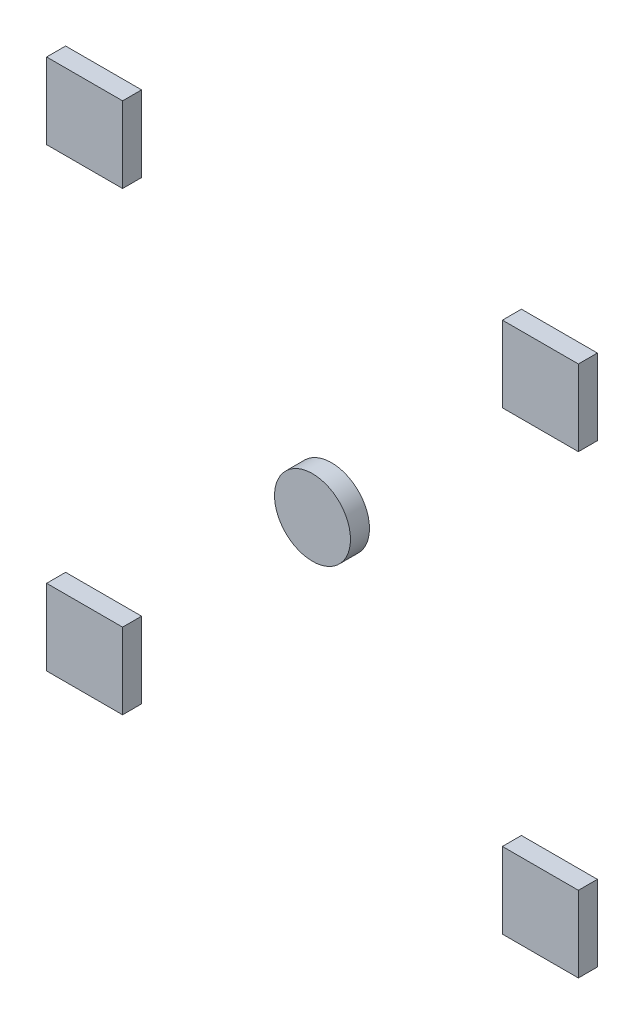
ISO-10303-21;
HEADER;
FILE_DESCRIPTION(('STEP AP214'),'2;1');
FILE_NAME('part.step','',(''),(''),'','','');
FILE_SCHEMA(('AUTOMOTIVE_DESIGN { 1 0 10303 214 1 1 1 1 }'));
ENDSEC;
DATA;
#1=APPLICATION_CONTEXT('core data for automotive mechanical design processes');
#2=APPLICATION_PROTOCOL_DEFINITION('international standard','automotive_design',2000,#1);
#3=PRODUCT_CONTEXT('',#1,'mechanical');
#4=PRODUCT('Part','Part','',(#3));
#5=PRODUCT_RELATED_PRODUCT_CATEGORY('part','',(#4));
#6=PRODUCT_DEFINITION_FORMATION('','',#4);
#7=PRODUCT_DEFINITION_CONTEXT('part definition',#1,'design');
#8=PRODUCT_DEFINITION('design','',#6,#7);
#9=PRODUCT_DEFINITION_SHAPE('','',#8);
#10=(LENGTH_UNIT() NAMED_UNIT(*) SI_UNIT(.MILLI.,.METRE.));
#11=(NAMED_UNIT(*) PLANE_ANGLE_UNIT() SI_UNIT($,.RADIAN.));
#12=(NAMED_UNIT(*) SI_UNIT($,.STERADIAN.) SOLID_ANGLE_UNIT());
#13=UNCERTAINTY_MEASURE_WITH_UNIT(LENGTH_MEASURE(1.E-05),#10,'distance_accuracy_value','');
#14=(GEOMETRIC_REPRESENTATION_CONTEXT(3) GLOBAL_UNCERTAINTY_ASSIGNED_CONTEXT((#13)) GLOBAL_UNIT_ASSIGNED_CONTEXT((#10,
#11,#12)) REPRESENTATION_CONTEXT('',''));
#15=CARTESIAN_POINT('',(0.,0.,0.));
#16=DIRECTION('',(0.,0.,1.));
#17=DIRECTION('',(1.,0.,0.));
#18=AXIS2_PLACEMENT_3D('',#15,#16,#17);
#19=CARTESIAN_POINT('',(120.,120.,5.));
#20=DIRECTION('',(0.,1.,0.));
#21=DIRECTION('',(0.,0.,1.));
#22=AXIS2_PLACEMENT_3D('',#19,#20,#21);
#23=PLANE('',#22);
#24=DIRECTION('',(1.,0.,0.));
#25=VECTOR('',#24,1.);
#26=CARTESIAN_POINT('',(120.,120.,0.));
#27=LINE('',#26,#25);
#28=CARTESIAN_POINT('',(120.,120.,0.));
#29=VERTEX_POINT('',#28);
#30=CARTESIAN_POINT('',(140.,120.,0.));
#31=VERTEX_POINT('',#30);
#32=EDGE_CURVE('E105',#29,#31,#27,.T.);
#33=ORIENTED_EDGE('',*,*,#32,.T.);
#34=DIRECTION('',(0.,0.,-1.));
#35=VECTOR('',#34,1.);
#36=CARTESIAN_POINT('',(140.,120.,5.));
#37=LINE('',#36,#35);
#38=CARTESIAN_POINT('',(140.,120.,5.));
#39=VERTEX_POINT('',#38);
#40=EDGE_CURVE('E12',#39,#31,#37,.T.);
#41=ORIENTED_EDGE('',*,*,#40,.F.);
#42=DIRECTION('',(1.,0.,0.));
#43=VECTOR('',#42,1.);
#44=CARTESIAN_POINT('',(120.,120.,5.));
#45=LINE('',#44,#43);
#46=CARTESIAN_POINT('',(120.,120.,5.));
#47=VERTEX_POINT('',#46);
#48=EDGE_CURVE('E93',#47,#39,#45,.T.);
#49=ORIENTED_EDGE('',*,*,#48,.F.);
#50=DIRECTION('',(0.,0.,-1.));
#51=VECTOR('',#50,1.);
#52=CARTESIAN_POINT('',(120.,120.,5.));
#53=LINE('',#52,#51);
#54=EDGE_CURVE('E101',#47,#29,#53,.T.);
#55=ORIENTED_EDGE('',*,*,#54,.T.);
#56=EDGE_LOOP('',(#33,#41,#49,#55));
#57=FACE_BOUND('',#56,.T.);
#58=ADVANCED_FACE('F42',(#57),#23,.F.);
#59=CARTESIAN_POINT('',(140.,120.,5.));
#60=DIRECTION('',(-1.,0.,0.));
#61=DIRECTION('',(0.,0.,1.));
#62=AXIS2_PLACEMENT_3D('',#59,#60,#61);
#63=PLANE('',#62);
#64=DIRECTION('',(0.,1.,0.));
#65=VECTOR('',#64,1.);
#66=CARTESIAN_POINT('',(140.,120.,0.));
#67=LINE('',#66,#65);
#68=CARTESIAN_POINT('',(140.,140.,0.));
#69=VERTEX_POINT('',#68);
#70=EDGE_CURVE('E97',#31,#69,#67,.T.);
#71=ORIENTED_EDGE('',*,*,#70,.T.);
#72=DIRECTION('',(0.,0.,-1.));
#73=VECTOR('',#72,1.);
#74=CARTESIAN_POINT('',(140.,140.,5.));
#75=LINE('',#74,#73);
#76=CARTESIAN_POINT('',(140.,140.,5.));
#77=VERTEX_POINT('',#76);
#78=EDGE_CURVE('E50',#77,#69,#75,.T.);
#79=ORIENTED_EDGE('',*,*,#78,.F.);
#80=DIRECTION('',(0.,1.,0.));
#81=VECTOR('',#80,1.);
#82=CARTESIAN_POINT('',(140.,120.,5.));
#83=LINE('',#82,#81);
#84=EDGE_CURVE('E88',#39,#77,#83,.T.);
#85=ORIENTED_EDGE('',*,*,#84,.F.);
#86=ORIENTED_EDGE('',*,*,#40,.T.);
#87=EDGE_LOOP('',(#71,#79,#85,#86));
#88=FACE_BOUND('',#87,.T.);
#89=ADVANCED_FACE('F96',(#88),#63,.F.);
#90=CARTESIAN_POINT('',(120.,140.,5.));
#91=DIRECTION('',(0.,-1.,0.));
#92=DIRECTION('',(0.,0.,-1.));
#93=AXIS2_PLACEMENT_3D('',#90,#91,#92);
#94=PLANE('',#93);
#95=DIRECTION('',(-1.,0.,0.));
#96=VECTOR('',#95,1.);
#97=CARTESIAN_POINT('',(120.,140.,0.));
#98=LINE('',#97,#96);
#99=CARTESIAN_POINT('',(120.,140.,0.));
#100=VERTEX_POINT('',#99);
#101=EDGE_CURVE('E75',#69,#100,#98,.T.);
#102=ORIENTED_EDGE('',*,*,#101,.T.);
#103=DIRECTION('',(0.,0.,-1.));
#104=VECTOR('',#103,1.);
#105=CARTESIAN_POINT('',(120.,140.,5.));
#106=LINE('',#105,#104);
#107=CARTESIAN_POINT('',(120.,140.,5.));
#108=VERTEX_POINT('',#107);
#109=EDGE_CURVE('E98',#108,#100,#106,.T.);
#110=ORIENTED_EDGE('',*,*,#109,.F.);
#111=DIRECTION('',(-1.,0.,0.));
#112=VECTOR('',#111,1.);
#113=CARTESIAN_POINT('',(120.,140.,5.));
#114=LINE('',#113,#112);
#115=EDGE_CURVE('E91',#77,#108,#114,.T.);
#116=ORIENTED_EDGE('',*,*,#115,.F.);
#117=ORIENTED_EDGE('',*,*,#78,.T.);
#118=EDGE_LOOP('',(#102,#110,#116,#117));
#119=FACE_BOUND('',#118,.T.);
#120=ADVANCED_FACE('F99',(#119),#94,.F.);
#121=CARTESIAN_POINT('',(120.,120.,5.));
#122=DIRECTION('',(1.,0.,0.));
#123=DIRECTION('',(0.,0.,-1.));
#124=AXIS2_PLACEMENT_3D('',#121,#122,#123);
#125=PLANE('',#124);
#126=DIRECTION('',(0.,-1.,0.));
#127=VECTOR('',#126,1.);
#128=CARTESIAN_POINT('',(120.,120.,0.));
#129=LINE('',#128,#127);
#130=EDGE_CURVE('E81',#100,#29,#129,.T.);
#131=ORIENTED_EDGE('',*,*,#130,.T.);
#132=ORIENTED_EDGE('',*,*,#54,.F.);
#133=DIRECTION('',(0.,-1.,0.));
#134=VECTOR('',#133,1.);
#135=CARTESIAN_POINT('',(120.,120.,5.));
#136=LINE('',#135,#134);
#137=EDGE_CURVE('E58',#108,#47,#136,.T.);
#138=ORIENTED_EDGE('',*,*,#137,.F.);
#139=ORIENTED_EDGE('',*,*,#109,.T.);
#140=EDGE_LOOP('',(#131,#132,#138,#139));
#141=FACE_BOUND('',#140,.T.);
#142=ADVANCED_FACE('F112',(#141),#125,.F.);
#143=CARTESIAN_POINT('',(140.,120.,5.));
#144=DIRECTION('',(0.,0.,1.));
#145=DIRECTION('',(1.,0.,0.));
#146=AXIS2_PLACEMENT_3D('',#143,#144,#145);
#147=PLANE('',#146);
#148=ORIENTED_EDGE('',*,*,#48,.T.);
#149=ORIENTED_EDGE('',*,*,#84,.T.);
#150=ORIENTED_EDGE('',*,*,#115,.T.);
#151=ORIENTED_EDGE('',*,*,#137,.T.);
#152=EDGE_LOOP('',(#148,#149,#150,#151));
#153=FACE_BOUND('',#152,.T.);
#154=ADVANCED_FACE('F89',(#153),#147,.T.);
#155=CARTESIAN_POINT('',(140.,120.,0.));
#156=DIRECTION('',(0.,0.,1.));
#157=DIRECTION('',(1.,0.,0.));
#158=AXIS2_PLACEMENT_3D('',#155,#156,#157);
#159=PLANE('',#158);
#160=ORIENTED_EDGE('',*,*,#32,.F.);
#161=ORIENTED_EDGE('',*,*,#130,.F.);
#162=ORIENTED_EDGE('',*,*,#101,.F.);
#163=ORIENTED_EDGE('',*,*,#70,.F.);
#164=EDGE_LOOP('',(#160,#161,#162,#163));
#165=FACE_BOUND('',#164,.T.);
#166=ADVANCED_FACE('F115',(#165),#159,.F.);
#167=CLOSED_SHELL('',(#58,#89,#120,#142,#154,#166));
#168=MANIFOLD_SOLID_BREP('B2',#167);
#169=CARTESIAN_POINT('',(-4.18978003333126E-13,120.,5.));
#170=DIRECTION('',(0.,1.,0.));
#171=DIRECTION('',(0.,0.,1.));
#172=AXIS2_PLACEMENT_3D('',#169,#170,#171);
#173=PLANE('',#172);
#174=DIRECTION('',(1.,0.,0.));
#175=VECTOR('',#174,1.);
#176=CARTESIAN_POINT('',(-4.18978003333126E-13,120.,0.));
#177=LINE('',#176,#175);
#178=CARTESIAN_POINT('',(-4.18978003333126E-13,120.,0.));
#179=VERTEX_POINT('',#178);
#180=CARTESIAN_POINT('',(19.9999999999996,120.,0.));
#181=VERTEX_POINT('',#180);
#182=EDGE_CURVE('E239',#179,#181,#177,.T.);
#183=ORIENTED_EDGE('',*,*,#182,.T.);
#184=DIRECTION('',(0.,0.,-1.));
#185=VECTOR('',#184,1.);
#186=CARTESIAN_POINT('',(19.9999999999996,120.,5.));
#187=LINE('',#186,#185);
#188=CARTESIAN_POINT('',(19.9999999999996,120.,5.));
#189=VERTEX_POINT('',#188);
#190=EDGE_CURVE('E40',#189,#181,#187,.T.);
#191=ORIENTED_EDGE('',*,*,#190,.F.);
#192=DIRECTION('',(1.,0.,0.));
#193=VECTOR('',#192,1.);
#194=CARTESIAN_POINT('',(-4.18978003333126E-13,120.,5.));
#195=LINE('',#194,#193);
#196=CARTESIAN_POINT('',(-4.18978003333126E-13,120.,5.));
#197=VERTEX_POINT('',#196);
#198=EDGE_CURVE('E227',#197,#189,#195,.T.);
#199=ORIENTED_EDGE('',*,*,#198,.F.);
#200=DIRECTION('',(0.,0.,-1.));
#201=VECTOR('',#200,1.);
#202=CARTESIAN_POINT('',(-4.18978003333126E-13,120.,5.));
#203=LINE('',#202,#201);
#204=EDGE_CURVE('E235',#197,#179,#203,.T.);
#205=ORIENTED_EDGE('',*,*,#204,.T.);
#206=EDGE_LOOP('',(#183,#191,#199,#205));
#207=FACE_BOUND('',#206,.T.);
#208=ADVANCED_FACE('F176',(#207),#173,.F.);
#209=CARTESIAN_POINT('',(19.9999999999996,120.,5.));
#210=DIRECTION('',(-1.,0.,0.));
#211=DIRECTION('',(0.,0.,1.));
#212=AXIS2_PLACEMENT_3D('',#209,#210,#211);
#213=PLANE('',#212);
#214=DIRECTION('',(0.,1.,0.));
#215=VECTOR('',#214,1.);
#216=CARTESIAN_POINT('',(19.9999999999996,120.,0.));
#217=LINE('',#216,#215);
#218=CARTESIAN_POINT('',(19.9999999999996,140.,0.));
#219=VERTEX_POINT('',#218);
#220=EDGE_CURVE('E231',#181,#219,#217,.T.);
#221=ORIENTED_EDGE('',*,*,#220,.T.);
#222=DIRECTION('',(0.,0.,-1.));
#223=VECTOR('',#222,1.);
#224=CARTESIAN_POINT('',(19.9999999999996,140.,5.));
#225=LINE('',#224,#223);
#226=CARTESIAN_POINT('',(19.9999999999996,140.,5.));
#227=VERTEX_POINT('',#226);
#228=EDGE_CURVE('E184',#227,#219,#225,.T.);
#229=ORIENTED_EDGE('',*,*,#228,.F.);
#230=DIRECTION('',(0.,1.,0.));
#231=VECTOR('',#230,1.);
#232=CARTESIAN_POINT('',(19.9999999999996,120.,5.));
#233=LINE('',#232,#231);
#234=EDGE_CURVE('E222',#189,#227,#233,.T.);
#235=ORIENTED_EDGE('',*,*,#234,.F.);
#236=ORIENTED_EDGE('',*,*,#190,.T.);
#237=EDGE_LOOP('',(#221,#229,#235,#236));
#238=FACE_BOUND('',#237,.T.);
#239=ADVANCED_FACE('F230',(#238),#213,.F.);
#240=CARTESIAN_POINT('',(-4.18978003333126E-13,140.,5.));
#241=DIRECTION('',(0.,-1.,0.));
#242=DIRECTION('',(0.,0.,-1.));
#243=AXIS2_PLACEMENT_3D('',#240,#241,#242);
#244=PLANE('',#243);
#245=DIRECTION('',(-1.,0.,0.));
#246=VECTOR('',#245,1.);
#247=CARTESIAN_POINT('',(-4.18978003333126E-13,140.,0.));
#248=LINE('',#247,#246);
#249=CARTESIAN_POINT('',(-4.18978003333126E-13,140.,0.));
#250=VERTEX_POINT('',#249);
#251=EDGE_CURVE('E209',#219,#250,#248,.T.);
#252=ORIENTED_EDGE('',*,*,#251,.T.);
#253=DIRECTION('',(0.,0.,-1.));
#254=VECTOR('',#253,1.);
#255=CARTESIAN_POINT('',(-4.18978003333126E-13,140.,5.));
#256=LINE('',#255,#254);
#257=CARTESIAN_POINT('',(-4.18978003333126E-13,140.,5.));
#258=VERTEX_POINT('',#257);
#259=EDGE_CURVE('E232',#258,#250,#256,.T.);
#260=ORIENTED_EDGE('',*,*,#259,.F.);
#261=DIRECTION('',(-1.,0.,0.));
#262=VECTOR('',#261,1.);
#263=CARTESIAN_POINT('',(-4.18978003333126E-13,140.,5.));
#264=LINE('',#263,#262);
#265=EDGE_CURVE('E225',#227,#258,#264,.T.);
#266=ORIENTED_EDGE('',*,*,#265,.F.);
#267=ORIENTED_EDGE('',*,*,#228,.T.);
#268=EDGE_LOOP('',(#252,#260,#266,#267));
#269=FACE_BOUND('',#268,.T.);
#270=ADVANCED_FACE('F233',(#269),#244,.F.);
#271=CARTESIAN_POINT('',(-4.18978003333126E-13,120.,5.));
#272=DIRECTION('',(1.,0.,0.));
#273=DIRECTION('',(0.,0.,-1.));
#274=AXIS2_PLACEMENT_3D('',#271,#272,#273);
#275=PLANE('',#274);
#276=DIRECTION('',(0.,-1.,0.));
#277=VECTOR('',#276,1.);
#278=CARTESIAN_POINT('',(-4.18978003333126E-13,120.,0.));
#279=LINE('',#278,#277);
#280=EDGE_CURVE('E215',#250,#179,#279,.T.);
#281=ORIENTED_EDGE('',*,*,#280,.T.);
#282=ORIENTED_EDGE('',*,*,#204,.F.);
#283=DIRECTION('',(0.,-1.,0.));
#284=VECTOR('',#283,1.);
#285=CARTESIAN_POINT('',(-4.18978003333126E-13,120.,5.));
#286=LINE('',#285,#284);
#287=EDGE_CURVE('E192',#258,#197,#286,.T.);
#288=ORIENTED_EDGE('',*,*,#287,.F.);
#289=ORIENTED_EDGE('',*,*,#259,.T.);
#290=EDGE_LOOP('',(#281,#282,#288,#289));
#291=FACE_BOUND('',#290,.T.);
#292=ADVANCED_FACE('F246',(#291),#275,.F.);
#293=CARTESIAN_POINT('',(19.9999999999996,120.,5.));
#294=DIRECTION('',(0.,0.,1.));
#295=DIRECTION('',(1.,0.,0.));
#296=AXIS2_PLACEMENT_3D('',#293,#294,#295);
#297=PLANE('',#296);
#298=ORIENTED_EDGE('',*,*,#198,.T.);
#299=ORIENTED_EDGE('',*,*,#234,.T.);
#300=ORIENTED_EDGE('',*,*,#265,.T.);
#301=ORIENTED_EDGE('',*,*,#287,.T.);
#302=EDGE_LOOP('',(#298,#299,#300,#301));
#303=FACE_BOUND('',#302,.T.);
#304=ADVANCED_FACE('F223',(#303),#297,.T.);
#305=CARTESIAN_POINT('',(19.9999999999996,120.,0.));
#306=DIRECTION('',(0.,0.,1.));
#307=DIRECTION('',(1.,0.,0.));
#308=AXIS2_PLACEMENT_3D('',#305,#306,#307);
#309=PLANE('',#308);
#310=ORIENTED_EDGE('',*,*,#182,.F.);
#311=ORIENTED_EDGE('',*,*,#280,.F.);
#312=ORIENTED_EDGE('',*,*,#251,.F.);
#313=ORIENTED_EDGE('',*,*,#220,.F.);
#314=EDGE_LOOP('',(#310,#311,#312,#313));
#315=FACE_BOUND('',#314,.T.);
#316=ADVANCED_FACE('F249',(#315),#309,.F.);
#317=CLOSED_SHELL('',(#208,#239,#270,#292,#304,#316));
#318=MANIFOLD_SOLID_BREP('B6',#317);
#319=CARTESIAN_POINT('',(120.,0.,5.));
#320=DIRECTION('',(0.,1.,0.));
#321=DIRECTION('',(0.,0.,1.));
#322=AXIS2_PLACEMENT_3D('',#319,#320,#321);
#323=PLANE('',#322);
#324=DIRECTION('',(1.,0.,0.));
#325=VECTOR('',#324,1.);
#326=CARTESIAN_POINT('',(120.,0.,0.));
#327=LINE('',#326,#325);
#328=CARTESIAN_POINT('',(120.,0.,0.));
#329=VERTEX_POINT('',#328);
#330=CARTESIAN_POINT('',(140.,0.,0.));
#331=VERTEX_POINT('',#330);
#332=EDGE_CURVE('E371',#329,#331,#327,.T.);
#333=ORIENTED_EDGE('',*,*,#332,.T.);
#334=DIRECTION('',(0.,0.,-1.));
#335=VECTOR('',#334,1.);
#336=CARTESIAN_POINT('',(140.,0.,5.));
#337=LINE('',#336,#335);
#338=CARTESIAN_POINT('',(140.,0.,5.));
#339=VERTEX_POINT('',#338);
#340=EDGE_CURVE('E174',#339,#331,#337,.T.);
#341=ORIENTED_EDGE('',*,*,#340,.F.);
#342=DIRECTION('',(1.,0.,0.));
#343=VECTOR('',#342,1.);
#344=CARTESIAN_POINT('',(120.,0.,5.));
#345=LINE('',#344,#343);
#346=CARTESIAN_POINT('',(120.,0.,5.));
#347=VERTEX_POINT('',#346);
#348=EDGE_CURVE('E359',#347,#339,#345,.T.);
#349=ORIENTED_EDGE('',*,*,#348,.F.);
#350=DIRECTION('',(0.,0.,-1.));
#351=VECTOR('',#350,1.);
#352=CARTESIAN_POINT('',(120.,0.,5.));
#353=LINE('',#352,#351);
#354=EDGE_CURVE('E367',#347,#329,#353,.T.);
#355=ORIENTED_EDGE('',*,*,#354,.T.);
#356=EDGE_LOOP('',(#333,#341,#349,#355));
#357=FACE_BOUND('',#356,.T.);
#358=ADVANCED_FACE('F308',(#357),#323,.F.);
#359=CARTESIAN_POINT('',(140.,0.,5.));
#360=DIRECTION('',(-1.,0.,0.));
#361=DIRECTION('',(0.,0.,1.));
#362=AXIS2_PLACEMENT_3D('',#359,#360,#361);
#363=PLANE('',#362);
#364=DIRECTION('',(0.,1.,0.));
#365=VECTOR('',#364,1.);
#366=CARTESIAN_POINT('',(140.,0.,0.));
#367=LINE('',#366,#365);
#368=CARTESIAN_POINT('',(140.,20.,0.));
#369=VERTEX_POINT('',#368);
#370=EDGE_CURVE('E363',#331,#369,#367,.T.);
#371=ORIENTED_EDGE('',*,*,#370,.T.);
#372=DIRECTION('',(0.,0.,-1.));
#373=VECTOR('',#372,1.);
#374=CARTESIAN_POINT('',(140.,20.,5.));
#375=LINE('',#374,#373);
#376=CARTESIAN_POINT('',(140.,20.,5.));
#377=VERTEX_POINT('',#376);
#378=EDGE_CURVE('E316',#377,#369,#375,.T.);
#379=ORIENTED_EDGE('',*,*,#378,.F.);
#380=DIRECTION('',(0.,1.,0.));
#381=VECTOR('',#380,1.);
#382=CARTESIAN_POINT('',(140.,0.,5.));
#383=LINE('',#382,#381);
#384=EDGE_CURVE('E354',#339,#377,#383,.T.);
#385=ORIENTED_EDGE('',*,*,#384,.F.);
#386=ORIENTED_EDGE('',*,*,#340,.T.);
#387=EDGE_LOOP('',(#371,#379,#385,#386));
#388=FACE_BOUND('',#387,.T.);
#389=ADVANCED_FACE('F362',(#388),#363,.F.);
#390=CARTESIAN_POINT('',(120.,20.,5.));
#391=DIRECTION('',(0.,-1.,0.));
#392=DIRECTION('',(0.,0.,-1.));
#393=AXIS2_PLACEMENT_3D('',#390,#391,#392);
#394=PLANE('',#393);
#395=DIRECTION('',(-1.,0.,0.));
#396=VECTOR('',#395,1.);
#397=CARTESIAN_POINT('',(120.,20.,0.));
#398=LINE('',#397,#396);
#399=CARTESIAN_POINT('',(120.,20.,0.));
#400=VERTEX_POINT('',#399);
#401=EDGE_CURVE('E341',#369,#400,#398,.T.);
#402=ORIENTED_EDGE('',*,*,#401,.T.);
#403=DIRECTION('',(0.,0.,-1.));
#404=VECTOR('',#403,1.);
#405=CARTESIAN_POINT('',(120.,20.,5.));
#406=LINE('',#405,#404);
#407=CARTESIAN_POINT('',(120.,20.,5.));
#408=VERTEX_POINT('',#407);
#409=EDGE_CURVE('E364',#408,#400,#406,.T.);
#410=ORIENTED_EDGE('',*,*,#409,.F.);
#411=DIRECTION('',(-1.,0.,0.));
#412=VECTOR('',#411,1.);
#413=CARTESIAN_POINT('',(120.,20.,5.));
#414=LINE('',#413,#412);
#415=EDGE_CURVE('E357',#377,#408,#414,.T.);
#416=ORIENTED_EDGE('',*,*,#415,.F.);
#417=ORIENTED_EDGE('',*,*,#378,.T.);
#418=EDGE_LOOP('',(#402,#410,#416,#417));
#419=FACE_BOUND('',#418,.T.);
#420=ADVANCED_FACE('F365',(#419),#394,.F.);
#421=CARTESIAN_POINT('',(120.,0.,5.));
#422=DIRECTION('',(1.,0.,0.));
#423=DIRECTION('',(0.,0.,-1.));
#424=AXIS2_PLACEMENT_3D('',#421,#422,#423);
#425=PLANE('',#424);
#426=DIRECTION('',(0.,-1.,0.));
#427=VECTOR('',#426,1.);
#428=CARTESIAN_POINT('',(120.,0.,0.));
#429=LINE('',#428,#427);
#430=EDGE_CURVE('E347',#400,#329,#429,.T.);
#431=ORIENTED_EDGE('',*,*,#430,.T.);
#432=ORIENTED_EDGE('',*,*,#354,.F.);
#433=DIRECTION('',(0.,-1.,0.));
#434=VECTOR('',#433,1.);
#435=CARTESIAN_POINT('',(120.,0.,5.));
#436=LINE('',#435,#434);
#437=EDGE_CURVE('E324',#408,#347,#436,.T.);
#438=ORIENTED_EDGE('',*,*,#437,.F.);
#439=ORIENTED_EDGE('',*,*,#409,.T.);
#440=EDGE_LOOP('',(#431,#432,#438,#439));
#441=FACE_BOUND('',#440,.T.);
#442=ADVANCED_FACE('F378',(#441),#425,.F.);
#443=CARTESIAN_POINT('',(140.,0.,5.));
#444=DIRECTION('',(0.,0.,1.));
#445=DIRECTION('',(1.,0.,0.));
#446=AXIS2_PLACEMENT_3D('',#443,#444,#445);
#447=PLANE('',#446);
#448=ORIENTED_EDGE('',*,*,#348,.T.);
#449=ORIENTED_EDGE('',*,*,#384,.T.);
#450=ORIENTED_EDGE('',*,*,#415,.T.);
#451=ORIENTED_EDGE('',*,*,#437,.T.);
#452=EDGE_LOOP('',(#448,#449,#450,#451));
#453=FACE_BOUND('',#452,.T.);
#454=ADVANCED_FACE('F355',(#453),#447,.T.);
#455=CARTESIAN_POINT('',(140.,0.,0.));
#456=DIRECTION('',(0.,0.,1.));
#457=DIRECTION('',(1.,0.,0.));
#458=AXIS2_PLACEMENT_3D('',#455,#456,#457);
#459=PLANE('',#458);
#460=ORIENTED_EDGE('',*,*,#332,.F.);
#461=ORIENTED_EDGE('',*,*,#430,.F.);
#462=ORIENTED_EDGE('',*,*,#401,.F.);
#463=ORIENTED_EDGE('',*,*,#370,.F.);
#464=EDGE_LOOP('',(#460,#461,#462,#463));
#465=FACE_BOUND('',#464,.T.);
#466=ADVANCED_FACE('F381',(#465),#459,.F.);
#467=CLOSED_SHELL('',(#358,#389,#420,#442,#454,#466));
#468=MANIFOLD_SOLID_BREP('B34',#467);
#469=CARTESIAN_POINT('',(69.9999999999998,70.,5.));
#470=DIRECTION('',(0.,0.,-1.));
#471=DIRECTION('',(-1.,0.,0.));
#472=AXIS2_PLACEMENT_3D('',#469,#470,#471);
#473=CYLINDRICAL_SURFACE('',#472,9.99999999999999);
#474=CARTESIAN_POINT('',(69.9999999999998,70.,5.));
#475=DIRECTION('',(0.,0.,1.));
#476=DIRECTION('',(1.,0.,0.));
#477=AXIS2_PLACEMENT_3D('',#474,#475,#476);
#478=CIRCLE('',#477,9.99999999999999);
#479=CARTESIAN_POINT('',(79.9999999999998,70.,5.));
#480=VERTEX_POINT('',#479);
#481=EDGE_CURVE('E307',#480,#480,#478,.T.);
#482=ORIENTED_EDGE('',*,*,#481,.F.);
#483=EDGE_LOOP('',(#482));
#484=FACE_BOUND('',#483,.T.);
#485=CARTESIAN_POINT('',(69.9999999999998,70.,0.));
#486=DIRECTION('',(0.,0.,1.));
#487=DIRECTION('',(1.,0.,0.));
#488=AXIS2_PLACEMENT_3D('',#485,#486,#487);
#489=CIRCLE('',#488,9.99999999999999);
#490=CARTESIAN_POINT('',(79.9999999999998,70.,0.));
#491=VERTEX_POINT('',#490);
#492=EDGE_CURVE('E444',#491,#491,#489,.T.);
#493=ORIENTED_EDGE('',*,*,#492,.T.);
#494=EDGE_LOOP('',(#493));
#495=FACE_BOUND('',#494,.T.);
#496=ADVANCED_FACE('F441',(#484,#495),#473,.T.);
#497=CARTESIAN_POINT('',(69.9999999999998,70.,5.));
#498=DIRECTION('',(0.,0.,1.));
#499=DIRECTION('',(1.,0.,0.));
#500=AXIS2_PLACEMENT_3D('',#497,#498,#499);
#501=PLANE('',#500);
#502=ORIENTED_EDGE('',*,*,#481,.T.);
#503=EDGE_LOOP('',(#502));
#504=FACE_BOUND('',#503,.T.);
#505=ADVANCED_FACE('F456',(#504),#501,.T.);
#506=CARTESIAN_POINT('',(69.9999999999998,70.,0.));
#507=DIRECTION('',(0.,0.,1.));
#508=DIRECTION('',(1.,0.,0.));
#509=AXIS2_PLACEMENT_3D('',#506,#507,#508);
#510=PLANE('',#509);
#511=ORIENTED_EDGE('',*,*,#492,.F.);
#512=EDGE_LOOP('',(#511));
#513=FACE_BOUND('',#512,.T.);
#514=ADVANCED_FACE('F454',(#513),#510,.F.);
#515=CLOSED_SHELL('',(#496,#505,#514));
#516=MANIFOLD_SOLID_BREP('B168',#515);
#517=CARTESIAN_POINT('',(0.,0.,5.));
#518=DIRECTION('',(1.,0.,0.));
#519=DIRECTION('',(0.,0.,-1.));
#520=AXIS2_PLACEMENT_3D('',#517,#518,#519);
#521=PLANE('',#520);
#522=DIRECTION('',(0.,-1.,0.));
#523=VECTOR('',#522,1.);
#524=CARTESIAN_POINT('',(0.,0.,0.));
#525=LINE('',#524,#523);
#526=CARTESIAN_POINT('',(0.,20.,0.));
#527=VERTEX_POINT('',#526);
#528=CARTESIAN_POINT('',(0.,0.,0.));
#529=VERTEX_POINT('',#528);
#530=EDGE_CURVE('E545',#527,#529,#525,.T.);
#531=ORIENTED_EDGE('',*,*,#530,.T.);
#532=DIRECTION('',(0.,0.,-1.));
#533=VECTOR('',#532,1.);
#534=CARTESIAN_POINT('',(0.,0.,5.));
#535=LINE('',#534,#533);
#536=CARTESIAN_POINT('',(0.,0.,5.));
#537=VERTEX_POINT('',#536);
#538=EDGE_CURVE('E439',#537,#529,#535,.T.);
#539=ORIENTED_EDGE('',*,*,#538,.F.);
#540=DIRECTION('',(0.,-1.,0.));
#541=VECTOR('',#540,1.);
#542=CARTESIAN_POINT('',(0.,0.,5.));
#543=LINE('',#542,#541);
#544=CARTESIAN_POINT('',(0.,20.,5.));
#545=VERTEX_POINT('',#544);
#546=EDGE_CURVE('E533',#545,#537,#543,.T.);
#547=ORIENTED_EDGE('',*,*,#546,.F.);
#548=DIRECTION('',(0.,0.,-1.));
#549=VECTOR('',#548,1.);
#550=CARTESIAN_POINT('',(0.,20.,5.));
#551=LINE('',#550,#549);
#552=EDGE_CURVE('E541',#545,#527,#551,.T.);
#553=ORIENTED_EDGE('',*,*,#552,.T.);
#554=EDGE_LOOP('',(#531,#539,#547,#553));
#555=FACE_BOUND('',#554,.T.);
#556=ADVANCED_FACE('F482',(#555),#521,.F.);
#557=CARTESIAN_POINT('',(0.,0.,5.));
#558=DIRECTION('',(0.,1.,0.));
#559=DIRECTION('',(0.,0.,1.));
#560=AXIS2_PLACEMENT_3D('',#557,#558,#559);
#561=PLANE('',#560);
#562=DIRECTION('',(1.,0.,0.));
#563=VECTOR('',#562,1.);
#564=CARTESIAN_POINT('',(0.,0.,0.));
#565=LINE('',#564,#563);
#566=CARTESIAN_POINT('',(20.,0.,0.));
#567=VERTEX_POINT('',#566);
#568=EDGE_CURVE('E537',#529,#567,#565,.T.);
#569=ORIENTED_EDGE('',*,*,#568,.T.);
#570=DIRECTION('',(0.,0.,-1.));
#571=VECTOR('',#570,1.);
#572=CARTESIAN_POINT('',(20.,0.,5.));
#573=LINE('',#572,#571);
#574=CARTESIAN_POINT('',(20.,0.,5.));
#575=VERTEX_POINT('',#574);
#576=EDGE_CURVE('E490',#575,#567,#573,.T.);
#577=ORIENTED_EDGE('',*,*,#576,.F.);
#578=DIRECTION('',(1.,0.,0.));
#579=VECTOR('',#578,1.);
#580=CARTESIAN_POINT('',(0.,0.,5.));
#581=LINE('',#580,#579);
#582=EDGE_CURVE('E528',#537,#575,#581,.T.);
#583=ORIENTED_EDGE('',*,*,#582,.F.);
#584=ORIENTED_EDGE('',*,*,#538,.T.);
#585=EDGE_LOOP('',(#569,#577,#583,#584));
#586=FACE_BOUND('',#585,.T.);
#587=ADVANCED_FACE('F536',(#586),#561,.F.);
#588=CARTESIAN_POINT('',(20.,0.,5.));
#589=DIRECTION('',(-1.,0.,0.));
#590=DIRECTION('',(0.,0.,1.));
#591=AXIS2_PLACEMENT_3D('',#588,#589,#590);
#592=PLANE('',#591);
#593=DIRECTION('',(0.,1.,0.));
#594=VECTOR('',#593,1.);
#595=CARTESIAN_POINT('',(20.,0.,0.));
#596=LINE('',#595,#594);
#597=CARTESIAN_POINT('',(20.,20.,0.));
#598=VERTEX_POINT('',#597);
#599=EDGE_CURVE('E515',#567,#598,#596,.T.);
#600=ORIENTED_EDGE('',*,*,#599,.T.);
#601=DIRECTION('',(0.,0.,-1.));
#602=VECTOR('',#601,1.);
#603=CARTESIAN_POINT('',(20.,20.,5.));
#604=LINE('',#603,#602);
#605=CARTESIAN_POINT('',(20.,20.,5.));
#606=VERTEX_POINT('',#605);
#607=EDGE_CURVE('E538',#606,#598,#604,.T.);
#608=ORIENTED_EDGE('',*,*,#607,.F.);
#609=DIRECTION('',(0.,1.,0.));
#610=VECTOR('',#609,1.);
#611=CARTESIAN_POINT('',(20.,0.,5.));
#612=LINE('',#611,#610);
#613=EDGE_CURVE('E531',#575,#606,#612,.T.);
#614=ORIENTED_EDGE('',*,*,#613,.F.);
#615=ORIENTED_EDGE('',*,*,#576,.T.);
#616=EDGE_LOOP('',(#600,#608,#614,#615));
#617=FACE_BOUND('',#616,.T.);
#618=ADVANCED_FACE('F539',(#617),#592,.F.);
#619=CARTESIAN_POINT('',(0.,20.,5.));
#620=DIRECTION('',(0.,-1.,0.));
#621=DIRECTION('',(0.,0.,-1.));
#622=AXIS2_PLACEMENT_3D('',#619,#620,#621);
#623=PLANE('',#622);
#624=DIRECTION('',(-1.,0.,0.));
#625=VECTOR('',#624,1.);
#626=CARTESIAN_POINT('',(0.,20.,0.));
#627=LINE('',#626,#625);
#628=EDGE_CURVE('E521',#598,#527,#627,.T.);
#629=ORIENTED_EDGE('',*,*,#628,.T.);
#630=ORIENTED_EDGE('',*,*,#552,.F.);
#631=DIRECTION('',(-1.,0.,0.));
#632=VECTOR('',#631,1.);
#633=CARTESIAN_POINT('',(0.,20.,5.));
#634=LINE('',#633,#632);
#635=EDGE_CURVE('E498',#606,#545,#634,.T.);
#636=ORIENTED_EDGE('',*,*,#635,.F.);
#637=ORIENTED_EDGE('',*,*,#607,.T.);
#638=EDGE_LOOP('',(#629,#630,#636,#637));
#639=FACE_BOUND('',#638,.T.);
#640=ADVANCED_FACE('F552',(#639),#623,.F.);
#641=CARTESIAN_POINT('',(0.,20.,5.));
#642=DIRECTION('',(0.,0.,-1.));
#643=DIRECTION('',(-1.,0.,0.));
#644=AXIS2_PLACEMENT_3D('',#641,#642,#643);
#645=PLANE('',#644);
#646=ORIENTED_EDGE('',*,*,#546,.T.);
#647=ORIENTED_EDGE('',*,*,#582,.T.);
#648=ORIENTED_EDGE('',*,*,#613,.T.);
#649=ORIENTED_EDGE('',*,*,#635,.T.);
#650=EDGE_LOOP('',(#646,#647,#648,#649));
#651=FACE_BOUND('',#650,.T.);
#652=ADVANCED_FACE('F529',(#651),#645,.F.);
#653=CARTESIAN_POINT('',(0.,20.,0.));
#654=DIRECTION('',(0.,0.,-1.));
#655=DIRECTION('',(-1.,0.,0.));
#656=AXIS2_PLACEMENT_3D('',#653,#654,#655);
#657=PLANE('',#656);
#658=ORIENTED_EDGE('',*,*,#530,.F.);
#659=ORIENTED_EDGE('',*,*,#628,.F.);
#660=ORIENTED_EDGE('',*,*,#599,.F.);
#661=ORIENTED_EDGE('',*,*,#568,.F.);
#662=EDGE_LOOP('',(#658,#659,#660,#661));
#663=FACE_BOUND('',#662,.T.);
#664=ADVANCED_FACE('F555',(#663),#657,.T.);
#665=CLOSED_SHELL('',(#556,#587,#618,#640,#652,#664));
#666=MANIFOLD_SOLID_BREP('B302',#665);
#667=ADVANCED_BREP_SHAPE_REPRESENTATION('',(#18,#168,#318,#468,#516,#666),#14);
#668=SHAPE_DEFINITION_REPRESENTATION(#9,#667);
ENDSEC;
END-ISO-10303-21;
